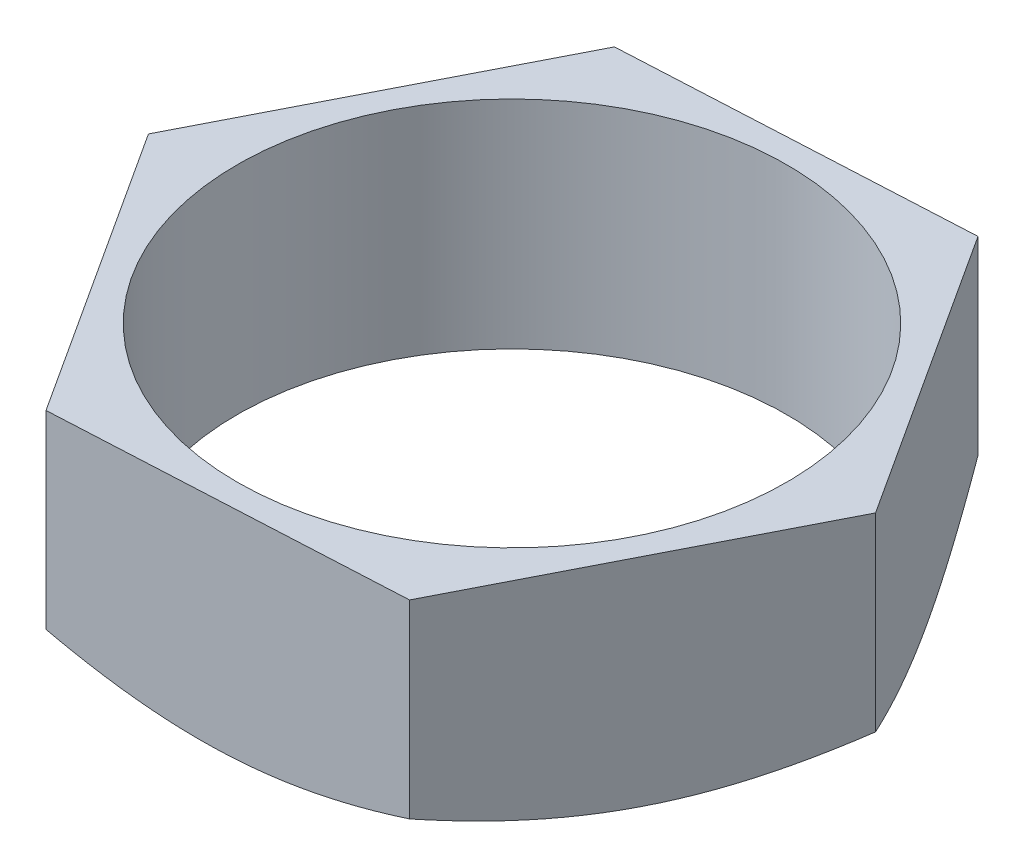
ISO-10303-21;
HEADER;
FILE_DESCRIPTION(('STEP AP214'),'2;1');
FILE_NAME('part.step','',(''),(''),'','','');
FILE_SCHEMA(('AUTOMOTIVE_DESIGN { 1 0 10303 214 1 1 1 1 }'));
ENDSEC;
DATA;
#1=APPLICATION_CONTEXT('core data for automotive mechanical design processes');
#2=APPLICATION_PROTOCOL_DEFINITION('international standard','automotive_design',2000,#1);
#3=PRODUCT_CONTEXT('',#1,'mechanical');
#4=PRODUCT('Part','Part','',(#3));
#5=PRODUCT_RELATED_PRODUCT_CATEGORY('part','',(#4));
#6=PRODUCT_DEFINITION_FORMATION('','',#4);
#7=PRODUCT_DEFINITION_CONTEXT('part definition',#1,'design');
#8=PRODUCT_DEFINITION('design','',#6,#7);
#9=PRODUCT_DEFINITION_SHAPE('','',#8);
#10=(LENGTH_UNIT() NAMED_UNIT(*) SI_UNIT(.MILLI.,.METRE.));
#11=(NAMED_UNIT(*) PLANE_ANGLE_UNIT() SI_UNIT($,.RADIAN.));
#12=(NAMED_UNIT(*) SI_UNIT($,.STERADIAN.) SOLID_ANGLE_UNIT());
#13=UNCERTAINTY_MEASURE_WITH_UNIT(LENGTH_MEASURE(1.E-05),#10,'distance_accuracy_value','');
#14=(GEOMETRIC_REPRESENTATION_CONTEXT(3) GLOBAL_UNCERTAINTY_ASSIGNED_CONTEXT((#13)) GLOBAL_UNIT_ASSIGNED_CONTEXT((#10,
#11,#12)) REPRESENTATION_CONTEXT('',''));
#15=CARTESIAN_POINT('',(0.,0.,0.));
#16=DIRECTION('',(0.,0.,1.));
#17=DIRECTION('',(1.,0.,0.));
#18=AXIS2_PLACEMENT_3D('',#15,#16,#17);
#19=CARTESIAN_POINT('',(0.,0.,0.));
#20=DIRECTION('',(0.,1.,0.));
#21=DIRECTION('',(0.,0.,1.));
#22=AXIS2_PLACEMENT_3D('',#19,#20,#21);
#23=PLANE('',#22);
#24=CARTESIAN_POINT('',(0.,0.,0.));
#25=DIRECTION('',(0.,1.,0.));
#26=DIRECTION('',(0.,0.,1.));
#27=AXIS2_PLACEMENT_3D('',#24,#25,#26);
#28=CIRCLE('',#27,6.35);
#29=CARTESIAN_POINT('',(0.,0.,6.35));
#30=VERTEX_POINT('',#29);
#31=EDGE_CURVE('E261',#30,#30,#28,.T.);
#32=ORIENTED_EDGE('',*,*,#31,.T.);
#33=EDGE_LOOP('',(#32));
#34=FACE_BOUND('',#33,.T.);
#35=CARTESIAN_POINT('',(0.,0.,0.));
#36=DIRECTION('',(0.,-1.,0.));
#37=DIRECTION('',(0.,0.,-1.));
#38=AXIS2_PLACEMENT_3D('',#35,#36,#37);
#39=CIRCLE('',#38,6.92820323027551);
#40=CARTESIAN_POINT('',(6.16907881852297,0.,3.15316769786374));
#41=VERTEX_POINT('',#40);
#42=CARTESIAN_POINT('',(0.35381608051899,0.,6.91916282372125));
#43=VERTEX_POINT('',#42);
#44=EDGE_CURVE('E118',#41,#43,#39,.T.);
#45=ORIENTED_EDGE('',*,*,#44,.T.);
#46=CARTESIAN_POINT('',(-5.81526273800398,0.,3.76599512585751));
#47=VERTEX_POINT('',#46);
#48=EDGE_CURVE('E107',#43,#47,#39,.T.);
#49=ORIENTED_EDGE('',*,*,#48,.T.);
#50=CARTESIAN_POINT('',(-6.16907881852297,0.,-3.15316769786374));
#51=VERTEX_POINT('',#50);
#52=EDGE_CURVE('E119',#47,#51,#39,.T.);
#53=ORIENTED_EDGE('',*,*,#52,.T.);
#54=CARTESIAN_POINT('',(-0.353816080518988,0.,-6.91916282372125));
#55=VERTEX_POINT('',#54);
#56=EDGE_CURVE('E279',#51,#55,#39,.T.);
#57=ORIENTED_EDGE('',*,*,#56,.T.);
#58=CARTESIAN_POINT('',(5.81526273800398,0.,-3.76599512585751));
#59=VERTEX_POINT('',#58);
#60=EDGE_CURVE('E138',#55,#59,#39,.T.);
#61=ORIENTED_EDGE('',*,*,#60,.T.);
#62=EDGE_CURVE('E53',#59,#41,#39,.T.);
#63=ORIENTED_EDGE('',*,*,#62,.T.);
#64=EDGE_LOOP('',(#45,#49,#53,#57,#61,#63));
#65=FACE_BOUND('',#64,.T.);
#66=ADVANCED_FACE('F33',(#34,#65),#23,.F.);
#67=CARTESIAN_POINT('',(7.98956103768463,5.,-0.408551618662516));
#68=DIRECTION('',(-0.839360876798749,0.,0.543574574920163));
#69=DIRECTION('',(0.543574574920163,0.,0.839360876798749));
#70=AXIS2_PLACEMENT_3D('',#67,#68,#69);
#71=PLANE('',#70);
#72=CARTESIAN_POINT('',(3.64083491725797,0.61887093956387,-7.12363863305251));
#73=CARTESIAN_POINT('',(3.73642202467926,0.568115199335291,-6.97603776649693));
#74=CARTESIAN_POINT('',(3.83236552712366,0.519662935744057,-6.82788657243732));
#75=CARTESIAN_POINT('',(4.02503169663145,0.42799978647294,-6.53038103698936));
#76=CARTESIAN_POINT('',(4.12175468077262,0.384791161852838,-6.38102620598527));
#77=CARTESIAN_POINT('',(4.41347229011371,0.263878862406307,-5.93057035383263));
#78=CARTESIAN_POINT('',(4.60961842442482,0.195105260290996,-5.62769122947284));
#79=CARTESIAN_POINT('',(4.90314754605218,0.114459988531889,-5.17443812996705));
#80=CARTESIAN_POINT('',(4.99965349862305,0.0914864615273886,-5.02541842834087));
#81=CARTESIAN_POINT('',(5.19310146458787,0.0529631493144572,-4.72670568161055));
#82=CARTESIAN_POINT('',(5.29004343868931,0.0374127081807483,-4.57701269717997));
#83=CARTESIAN_POINT('',(5.48409575553106,0.0141318753304187,-4.27736674182408));
#84=CARTESIAN_POINT('',(5.58120578133457,0.00639260875546628,-4.12741426029686));
#85=CARTESIAN_POINT('',(5.77551017839809,-0.00110822728907233,-3.82737905517519));
#86=CARTESIAN_POINT('',(5.87270454695972,-0.000870043208922834,-3.67729633574747));
#87=CARTESIAN_POINT('',(6.13898563527347,0.0107480068437652,-3.26611829675479));
#88=CARTESIAN_POINT('',(6.30798519005466,0.0302518528030116,-3.00515757301127));
#89=CARTESIAN_POINT('',(6.6448618183566,0.092098779830511,-2.48496940536922));
#90=CARTESIAN_POINT('',(6.81273770713315,0.13446299987481,-2.22574379089389));
#91=CARTESIAN_POINT('',(7.15029230064105,0.24036128163059,-1.70450874303343));
#92=CARTESIAN_POINT('',(7.31992841228258,0.304344023962348,-1.44256507978341));
#93=CARTESIAN_POINT('',(7.65667088005869,0.449559043679214,-0.922584076165926));
#94=CARTESIAN_POINT('',(7.82378154876104,0.530757210595676,-0.664540076545389));
#95=CARTESIAN_POINT('',(7.98969055874999,0.618870939563869,-0.408351618662516));
#96=B_SPLINE_CURVE_WITH_KNOTS('',3,(#72,#73,#74,#75,#76,#77,#78,#79,#80,#81,#82,#83,#84,#85,#86,
#87,#88,#89,#90,#91,#92,#93,#94,#95),.UNSPECIFIED.,.F.,.F.,(4,2,2,2,2,2,2,2,2,2,2,4),(0.,
0.549038574805348,1.09831306040419,2.19914443104398,2.73607817580193,3.27296446675901,
3.80924007211702,4.34549911013435,5.27906525860638,6.21349615824478,7.16865151028677,
8.12193172415134),.UNSPECIFIED.);
#97=CARTESIAN_POINT('',(3.64096443832333,0.618802153517004,-7.12343863305251));
#98=VERTEX_POINT('',#97);
#99=EDGE_CURVE('E136',#98,#59,#96,.T.);
#100=ORIENTED_EDGE('',*,*,#99,.F.);
#101=DIRECTION('',(0.,-1.,0.));
#102=VECTOR('',#101,1.);
#103=CARTESIAN_POINT('',(3.64096443832333,5.,-7.12343863305251));
#104=LINE('',#103,#102);
#105=CARTESIAN_POINT('',(3.64096443832333,5.,-7.12343863305251));
#106=VERTEX_POINT('',#105);
#107=EDGE_CURVE('E236',#106,#98,#104,.T.);
#108=ORIENTED_EDGE('',*,*,#107,.F.);
#109=DIRECTION('',(-0.543574574920163,0.,-0.839360876798749));
#110=VECTOR('',#109,1.);
#111=CARTESIAN_POINT('',(7.98956103768463,5.,-0.408551618662516));
#112=LINE('',#111,#110);
#113=CARTESIAN_POINT('',(7.98956103768463,5.,-0.408551618662516));
#114=VERTEX_POINT('',#113);
#115=EDGE_CURVE('E221',#114,#106,#112,.T.);
#116=ORIENTED_EDGE('',*,*,#115,.F.);
#117=DIRECTION('',(0.,-1.,0.));
#118=VECTOR('',#117,1.);
#119=CARTESIAN_POINT('',(7.98956103768463,5.,-0.408551618662516));
#120=LINE('',#119,#118);
#121=CARTESIAN_POINT('',(7.98956103768463,0.618802153517004,-0.408551618662515));
#122=VERTEX_POINT('',#121);
#123=EDGE_CURVE('E215',#114,#122,#120,.T.);
#124=ORIENTED_EDGE('',*,*,#123,.T.);
#125=EDGE_CURVE('E129',#59,#122,#96,.T.);
#126=ORIENTED_EDGE('',*,*,#125,.F.);
#127=EDGE_LOOP('',(#100,#108,#116,#124,#126));
#128=FACE_BOUND('',#127,.T.);
#129=ADVANCED_FACE('F35',(#128),#71,.F.);
#130=CARTESIAN_POINT('',(3.64096443832333,5.,-7.12343863305251));
#131=DIRECTION('',(0.051068952332814,0.,0.998695129710578));
#132=DIRECTION('',(0.998695129710578,0.,-0.051068952332814));
#133=AXIS2_PLACEMENT_3D('',#130,#131,#132);
#134=PLANE('',#133);
#135=CARTESIAN_POINT('',(-4.3487965993613,0.618859965064425,-6.71487678725444));
#136=CARTESIAN_POINT('',(-4.17317726526415,0.56810467887728,-6.72385720093116));
#137=CARTESIAN_POINT('',(-3.99690313762514,0.519652880306709,-6.73287109791944));
#138=CARTESIAN_POINT('',(-3.642923350534,0.427990681264755,-6.75097209424549));
#139=CARTESIAN_POINT('',(-3.46521710852659,0.384782541859749,-6.76005922337263));
#140=CARTESIAN_POINT('',(-2.92925311379517,0.263871731938269,-6.78746610549788));
#141=CARTESIAN_POINT('',(-2.56887973901881,0.195099159829299,-6.80589404226353));
#142=CARTESIAN_POINT('',(-2.02958754678634,0.114455422849705,-6.83347111402372));
#143=CARTESIAN_POINT('',(-1.852280053513,0.0914823978318176,-6.84253785286408));
#144=CARTESIAN_POINT('',(-1.49686392370309,0.0529600848180451,-6.86071229754855));
#145=CARTESIAN_POINT('',(-1.31875535935547,0.0374101409010253,-6.86981999970123));
#146=CARTESIAN_POINT('',(-0.96222890858955,0.0141302848300211,-6.88805122140032));
#147=CARTESIAN_POINT('',(-0.783811604434302,0.00639149801764774,-6.89717471117231));
#148=CARTESIAN_POINT('',(-0.426822051538732,-0.00110840719038422,-6.91542961391267));
#149=CARTESIAN_POINT('',(-0.248249807755767,-0.000869772050792777,-6.92456102662754));
#150=CARTESIAN_POINT('',(0.240975346651635,0.0107493392895683,-6.94957788647513));
#151=CARTESIAN_POINT('',(0.551468098255518,0.0302533681376942,-6.96545514376779));
#152=CARTESIAN_POINT('',(1.17039134300866,0.0920998006210819,-6.99710420336932));
#153=CARTESIAN_POINT('',(1.47881965964196,0.134463341267003,-7.01287589438057));
#154=CARTESIAN_POINT('',(2.09898839851385,0.240359502423459,-7.04458864316801));
#155=CARTESIAN_POINT('',(2.4106505705561,0.30434077627936,-7.06052569956738));
#156=CARTESIAN_POINT('',(3.02932725715202,0.449552301060211,-7.09216215125043));
#157=CARTESIAN_POINT('',(3.33634969438419,0.530748444288054,-7.10786195166566));
#158=CARTESIAN_POINT('',(3.64116443832333,0.618859965064425,-7.12344886018806));
#159=B_SPLINE_CURVE_WITH_KNOTS('',3,(#135,#136,#137,#138,#139,#140,#141,#142,#143,#144,#145,
#146,#147,#148,#149,#150,#151,#152,#153,#154,#155,#156,#157,#158),.UNSPECIFIED.,.F.,.F.,(4,2,2,
2,2,2,2,2,2,2,2,4),(0.,0.549037274261788,1.09831045855129,2.19913915498056,2.73607172248169,
3.27295683655553,3.80923127881788,4.34548915274212,5.27903847804473,6.21345249109815,
7.16859006307516,8.12185262295156),.UNSPECIFIED.);
#160=CARTESIAN_POINT('',(-4.3485965993613,0.618802153517003,-6.71488701438999));
#161=VERTEX_POINT('',#160);
#162=EDGE_CURVE('E276',#161,#55,#159,.T.);
#163=ORIENTED_EDGE('',*,*,#162,.F.);
#164=DIRECTION('',(0.,-1.,0.));
#165=VECTOR('',#164,1.);
#166=CARTESIAN_POINT('',(-4.3485965993613,5.,-6.71488701438999));
#167=LINE('',#166,#165);
#168=CARTESIAN_POINT('',(-4.3485965993613,5.,-6.71488701438999));
#169=VERTEX_POINT('',#168);
#170=EDGE_CURVE('E234',#169,#161,#167,.T.);
#171=ORIENTED_EDGE('',*,*,#170,.F.);
#172=DIRECTION('',(-0.998695129710578,0.,0.051068952332814));
#173=VECTOR('',#172,1.);
#174=CARTESIAN_POINT('',(3.64096443832333,5.,-7.12343863305251));
#175=LINE('',#174,#173);
#176=EDGE_CURVE('E241',#106,#169,#175,.T.);
#177=ORIENTED_EDGE('',*,*,#176,.F.);
#178=ORIENTED_EDGE('',*,*,#107,.T.);
#179=EDGE_CURVE('E174',#55,#98,#159,.T.);
#180=ORIENTED_EDGE('',*,*,#179,.F.);
#181=EDGE_LOOP('',(#163,#171,#177,#178,#180));
#182=FACE_BOUND('',#181,.T.);
#183=ADVANCED_FACE('F186',(#182),#134,.F.);
#184=CARTESIAN_POINT('',(-4.3485965993613,5.,-6.71488701438999));
#185=DIRECTION('',(0.890429829131563,0.,0.455120554790415));
#186=DIRECTION('',(0.455120554790415,0.,-0.890429829131563));
#187=AXIS2_PLACEMENT_3D('',#184,#185,#186);
#188=PLANE('',#187);
#189=CARTESIAN_POINT('',(-7.98966326259666,0.618866994384585,0.408751618662515));
#190=CARTESIAN_POINT('',(-7.90963076861918,0.568111417377126,0.252170424543161));
#191=CARTESIAN_POINT('',(-7.82929987481131,0.519659320953879,0.0950054200307493));
#192=CARTESIAN_POINT('',(-7.66798571444291,0.427996513275969,-0.220600936881611));
#193=CARTESIAN_POINT('',(-7.58700218240213,0.384788063083458,-0.379042808685781));
#194=CARTESIAN_POINT('',(-7.3427549431192,0.263876299099011,-0.856905267876851));
#195=CARTESIAN_POINT('',(-7.17852711034747,0.195103067255689,-1.17821213818712));
#196=CARTESIAN_POINT('',(-6.93276314746032,0.114458347227141,-1.65904202199905));
#197=CARTESIAN_POINT('',(-6.85196133058139,0.0914850006794151,-1.81712837349367));
#198=CARTESIAN_POINT('',(-6.68999259790593,0.052962047663875,-2.13401538165634));
#199=CARTESIAN_POINT('',(-6.60882571500763,0.0374117852722727,-2.29281597395997));
#200=CARTESIAN_POINT('',(-6.44635098143223,0.0141313035598346,-2.61069295783374));
#201=CARTESIAN_POINT('',(-6.36504339611193,0.00639220945254382,-2.76976883024121));
#202=CARTESIAN_POINT('',(-6.20235760871444,-0.00110829196976968,-3.08805873464069));
#203=CARTESIAN_POINT('',(-6.1209794088965,-0.000869945740264138,-3.24727276221256));
#204=CARTESIAN_POINT('',(-5.89803031152865,0.0107484858329295,-3.68346604020175));
#205=CARTESIAN_POINT('',(-5.75653239704574,0.0302523975402912,-3.96030250141918));
#206=CARTESIAN_POINT('',(-5.47447638420087,0.0920991467891393,-4.51213670156564));
#207=CARTESIAN_POINT('',(-5.33391927776378,0.13446312260013,-4.78713249982318));
#208=CARTESIAN_POINT('',(-5.05129564122731,0.240360642031067,-5.34007723883986));
#209=CARTESIAN_POINT('',(-4.90926477237884,0.304342856466234,-5.61795640942224));
#210=CARTESIAN_POINT('',(-4.62732109981532,0.449556619802126,-6.16957081914951));
#211=CARTESIAN_POINT('',(-4.48740468541448,0.530754059230552,-6.44331312249376));
#212=CARTESIAN_POINT('',(-4.34849437444927,0.618866994384585,-6.71508701438999));
#213=B_SPLINE_CURVE_WITH_KNOTS('',3,(#189,#190,#191,#192,#193,#194,#195,#196,#197,#198,#199,
#200,#201,#202,#203,#204,#205,#206,#207,#208,#209,#210,#211,#212),.UNSPECIFIED.,.F.,.F.,(4,2,2,
2,2,2,2,2,2,2,2,4),(0.,0.549038107278163,1.09831212507454,2.19914253437313,2.73607585592367,
3.27296172380765,3.80923691104901,4.34549553059112,5.27905563138459,6.21348046054716,
7.168629420918,8.12190328843477),.UNSPECIFIED.);
#214=CARTESIAN_POINT('',(-7.98956103768463,0.618802153517002,0.408551618662515));
#215=VERTEX_POINT('',#214);
#216=EDGE_CURVE('E262',#215,#51,#213,.T.);
#217=ORIENTED_EDGE('',*,*,#216,.F.);
#218=DIRECTION('',(0.,-1.,0.));
#219=VECTOR('',#218,1.);
#220=CARTESIAN_POINT('',(-7.98956103768463,5.,0.408551618662515));
#221=LINE('',#220,#219);
#222=CARTESIAN_POINT('',(-7.98956103768463,5.,0.408551618662515));
#223=VERTEX_POINT('',#222);
#224=EDGE_CURVE('E231',#223,#215,#221,.T.);
#225=ORIENTED_EDGE('',*,*,#224,.F.);
#226=DIRECTION('',(-0.455120554790415,0.,0.890429829131563));
#227=VECTOR('',#226,1.);
#228=CARTESIAN_POINT('',(-4.3485965993613,5.,-6.71488701438999));
#229=LINE('',#228,#227);
#230=EDGE_CURVE('E268',#169,#223,#229,.T.);
#231=ORIENTED_EDGE('',*,*,#230,.F.);
#232=ORIENTED_EDGE('',*,*,#170,.T.);
#233=EDGE_CURVE('E161',#51,#161,#213,.T.);
#234=ORIENTED_EDGE('',*,*,#233,.F.);
#235=EDGE_LOOP('',(#217,#225,#231,#232,#234));
#236=FACE_BOUND('',#235,.T.);
#237=ADVANCED_FACE('F182',(#236),#188,.F.);
#238=CARTESIAN_POINT('',(-7.98956103768463,5.,0.408551618662515));
#239=DIRECTION('',(0.839360876798749,0.,-0.543574574920163));
#240=DIRECTION('',(-0.543574574920163,0.,-0.839360876798749));
#241=AXIS2_PLACEMENT_3D('',#238,#239,#240);
#242=PLANE('',#241);
#243=CARTESIAN_POINT('',(-3.64083491725796,0.618870939563869,7.12363863305251));
#244=CARTESIAN_POINT('',(-3.73642202467926,0.56811519933529,6.97603776649693));
#245=CARTESIAN_POINT('',(-3.83236552712365,0.519662935744056,6.82788657243732));
#246=CARTESIAN_POINT('',(-4.02503169663145,0.42799978647294,6.53038103698936));
#247=CARTESIAN_POINT('',(-4.12175468077261,0.384791161852837,6.38102620598527));
#248=CARTESIAN_POINT('',(-4.4134722901137,0.263878862406306,5.93057035383263));
#249=CARTESIAN_POINT('',(-4.60961842442481,0.195105260290995,5.62769122947285));
#250=CARTESIAN_POINT('',(-4.90314754605218,0.114459988531888,5.17443812996705));
#251=CARTESIAN_POINT('',(-4.99965349862304,0.0914864615273879,5.02541842834087));
#252=CARTESIAN_POINT('',(-5.19310146458786,0.0529631493144563,4.72670568161055));
#253=CARTESIAN_POINT('',(-5.2900434386893,0.0374127081807473,4.57701269717997));
#254=CARTESIAN_POINT('',(-5.48409575553106,0.0141318753304172,4.27736674182408));
#255=CARTESIAN_POINT('',(-5.58120578133456,0.00639260875546466,4.12741426029686));
#256=CARTESIAN_POINT('',(-5.77551017839809,-0.00110822728907396,3.8273790551752));
#257=CARTESIAN_POINT('',(-5.87270454695971,-0.000870043208924313,3.67729633574748));
#258=CARTESIAN_POINT('',(-6.13898563527347,0.0107480068437637,3.26611829675479));
#259=CARTESIAN_POINT('',(-6.30798519005466,0.0302518528030095,3.00515757301127));
#260=CARTESIAN_POINT('',(-6.6448618183566,0.0920987798305089,2.48496940536922));
#261=CARTESIAN_POINT('',(-6.81273770713314,0.134462999874809,2.22574379089389));
#262=CARTESIAN_POINT('',(-7.15029230064105,0.240361281630589,1.70450874303343));
#263=CARTESIAN_POINT('',(-7.31992841228258,0.304344023962347,1.44256507978341));
#264=CARTESIAN_POINT('',(-7.65667088005869,0.449559043679213,0.922584076165925));
#265=CARTESIAN_POINT('',(-7.82378154876104,0.530757210595675,0.664540076545389));
#266=CARTESIAN_POINT('',(-7.98969055874999,0.618870939563868,0.408351618662515));
#267=B_SPLINE_CURVE_WITH_KNOTS('',3,(#243,#244,#245,#246,#247,#248,#249,#250,#251,#252,#253,
#254,#255,#256,#257,#258,#259,#260,#261,#262,#263,#264,#265,#266),.UNSPECIFIED.,.F.,.F.,(4,2,2,
2,2,2,2,2,2,2,2,4),(0.,0.549038574805348,1.09831306040418,2.19914443104398,2.73607817580192,
3.27296446675901,3.80924007211702,4.34549911013435,5.27906525860638,6.21349615824478,
7.16865151028677,8.12193172415134),.UNSPECIFIED.);
#268=CARTESIAN_POINT('',(-3.64096443832332,0.618802153517004,7.12343863305251));
#269=VERTEX_POINT('',#268);
#270=EDGE_CURVE('E113',#269,#47,#267,.T.);
#271=ORIENTED_EDGE('',*,*,#270,.F.);
#272=DIRECTION('',(0.,-1.,0.));
#273=VECTOR('',#272,1.);
#274=CARTESIAN_POINT('',(-3.64096443832332,5.,7.12343863305251));
#275=LINE('',#274,#273);
#276=CARTESIAN_POINT('',(-3.64096443832332,5.,7.12343863305251));
#277=VERTEX_POINT('',#276);
#278=EDGE_CURVE('E135',#277,#269,#275,.T.);
#279=ORIENTED_EDGE('',*,*,#278,.F.);
#280=DIRECTION('',(0.543574574920163,0.,0.839360876798749));
#281=VECTOR('',#280,1.);
#282=CARTESIAN_POINT('',(-7.98956103768463,5.,0.408551618662515));
#283=LINE('',#282,#281);
#284=EDGE_CURVE('E270',#223,#277,#283,.T.);
#285=ORIENTED_EDGE('',*,*,#284,.F.);
#286=ORIENTED_EDGE('',*,*,#224,.T.);
#287=EDGE_CURVE('E175',#47,#215,#267,.T.);
#288=ORIENTED_EDGE('',*,*,#287,.F.);
#289=EDGE_LOOP('',(#271,#279,#285,#286,#288));
#290=FACE_BOUND('',#289,.T.);
#291=ADVANCED_FACE('F179',(#290),#242,.F.);
#292=CARTESIAN_POINT('',(-3.64096443832332,5.,7.12343863305251));
#293=DIRECTION('',(-0.0510689523328142,0.,-0.998695129710578));
#294=DIRECTION('',(-0.998695129710578,0.,0.0510689523328142));
#295=AXIS2_PLACEMENT_3D('',#292,#293,#294);
#296=PLANE('',#295);
#297=CARTESIAN_POINT('',(4.3487965993613,0.618859965064425,6.71487678725444));
#298=CARTESIAN_POINT('',(4.17317726526415,0.56810467887728,6.72385720093116));
#299=CARTESIAN_POINT('',(3.99690313762515,0.519652880306709,6.73287109791944));
#300=CARTESIAN_POINT('',(3.642923350534,0.427990681264755,6.75097209424549));
#301=CARTESIAN_POINT('',(3.46521710852659,0.384782541859749,6.76005922337263));
#302=CARTESIAN_POINT('',(2.92925311379517,0.263871731938269,6.78746610549788));
#303=CARTESIAN_POINT('',(2.56887973901882,0.1950991598293,6.80589404226353));
#304=CARTESIAN_POINT('',(2.02958754678634,0.114455422849706,6.83347111402372));
#305=CARTESIAN_POINT('',(1.852280053513,0.0914823978318187,6.84253785286408));
#306=CARTESIAN_POINT('',(1.49686392370309,0.0529600848180459,6.86071229754855));
#307=CARTESIAN_POINT('',(1.31875535935547,0.0374101409010259,6.86981999970123));
#308=CARTESIAN_POINT('',(0.962228908589552,0.0141302848300214,6.88805122140032));
#309=CARTESIAN_POINT('',(0.783811604434303,0.00639149801764818,6.89717471117231));
#310=CARTESIAN_POINT('',(0.426822051538733,-0.00110840719038361,6.91542961391267));
#311=CARTESIAN_POINT('',(0.248249807755768,-0.000869772050792136,6.92456102662754));
#312=CARTESIAN_POINT('',(-0.240975346651634,0.0107493392895688,6.94957788647513));
#313=CARTESIAN_POINT('',(-0.551468098255517,0.0302533681376943,6.96545514376779));
#314=CARTESIAN_POINT('',(-1.17039134300866,0.0920998006210822,6.99710420336933));
#315=CARTESIAN_POINT('',(-1.47881965964195,0.134463341267004,7.01287589438058));
#316=CARTESIAN_POINT('',(-2.09898839851385,0.24035950242346,7.04458864316801));
#317=CARTESIAN_POINT('',(-2.4106505705561,0.30434077627936,7.06052569956738));
#318=CARTESIAN_POINT('',(-3.02932725715202,0.44955230106021,7.09216215125043));
#319=CARTESIAN_POINT('',(-3.33634969438419,0.530748444288053,7.10786195166566));
#320=CARTESIAN_POINT('',(-3.64116443832332,0.618859965064425,7.12344886018806));
#321=B_SPLINE_CURVE_WITH_KNOTS('',3,(#297,#298,#299,#300,#301,#302,#303,#304,#305,#306,#307,
#308,#309,#310,#311,#312,#313,#314,#315,#316,#317,#318,#319,#320),.UNSPECIFIED.,.F.,.F.,(4,2,2,
2,2,2,2,2,2,2,2,4),(0.,0.549037274261788,1.09831045855129,2.19913915498056,2.73607172248169,
3.27295683655553,3.80923127881788,4.34548915274212,5.27903847804473,6.21345249109815,
7.16859006307515,8.12185262295156),.UNSPECIFIED.);
#322=CARTESIAN_POINT('',(4.3485965993613,0.618802153517004,6.71488701438999));
#323=VERTEX_POINT('',#322);
#324=EDGE_CURVE('E123',#323,#43,#321,.T.);
#325=ORIENTED_EDGE('',*,*,#324,.F.);
#326=DIRECTION('',(0.,-1.,0.));
#327=VECTOR('',#326,1.);
#328=CARTESIAN_POINT('',(4.3485965993613,5.,6.71488701438999));
#329=LINE('',#328,#327);
#330=CARTESIAN_POINT('',(4.3485965993613,5.,6.71488701438999));
#331=VERTEX_POINT('',#330);
#332=EDGE_CURVE('E222',#331,#323,#329,.T.);
#333=ORIENTED_EDGE('',*,*,#332,.F.);
#334=DIRECTION('',(0.998695129710578,0.,-0.0510689523328142));
#335=VECTOR('',#334,1.);
#336=CARTESIAN_POINT('',(-3.64096443832332,5.,7.12343863305251));
#337=LINE('',#336,#335);
#338=EDGE_CURVE('E226',#277,#331,#337,.T.);
#339=ORIENTED_EDGE('',*,*,#338,.F.);
#340=ORIENTED_EDGE('',*,*,#278,.T.);
#341=EDGE_CURVE('E111',#43,#269,#321,.T.);
#342=ORIENTED_EDGE('',*,*,#341,.F.);
#343=EDGE_LOOP('',(#325,#333,#339,#340,#342));
#344=FACE_BOUND('',#343,.T.);
#345=ADVANCED_FACE('F132',(#344),#296,.F.);
#346=CARTESIAN_POINT('',(4.3485965993613,5.,6.71488701438999));
#347=DIRECTION('',(-0.890429829131563,0.,-0.455120554790415));
#348=DIRECTION('',(-0.455120554790416,0.,0.890429829131563));
#349=AXIS2_PLACEMENT_3D('',#346,#347,#348);
#350=PLANE('',#349);
#351=CARTESIAN_POINT('',(7.98966326259667,0.618866994384586,-0.408751618662516));
#352=CARTESIAN_POINT('',(7.90963076861918,0.568111417377127,-0.252170424543162));
#353=CARTESIAN_POINT('',(7.82929987481131,0.51965932095388,-0.0950054200307506));
#354=CARTESIAN_POINT('',(7.66798571444291,0.42799651327597,0.22060093688161));
#355=CARTESIAN_POINT('',(7.58700218240213,0.384788063083459,0.37904280868578));
#356=CARTESIAN_POINT('',(7.3427549431192,0.263876299099012,0.856905267876851));
#357=CARTESIAN_POINT('',(7.17852711034747,0.195103067255691,1.17821213818712));
#358=CARTESIAN_POINT('',(6.93276314746032,0.114458347227142,1.65904202199905));
#359=CARTESIAN_POINT('',(6.85196133058139,0.0914850006794159,1.81712837349367));
#360=CARTESIAN_POINT('',(6.68999259790593,0.0529620476638756,2.13401538165634));
#361=CARTESIAN_POINT('',(6.60882571500763,0.0374117852722735,2.29281597395997));
#362=CARTESIAN_POINT('',(6.44635098143223,0.0141313035598353,2.61069295783374));
#363=CARTESIAN_POINT('',(6.36504339611193,0.00639220945254445,2.76976883024121));
#364=CARTESIAN_POINT('',(6.20235760871444,-0.00110829196976905,3.08805873464069));
#365=CARTESIAN_POINT('',(6.1209794088965,-0.000869945740263427,3.24727276221256));
#366=CARTESIAN_POINT('',(5.89803031152865,0.0107484858329303,3.68346604020175));
#367=CARTESIAN_POINT('',(5.75653239704574,0.030252397540292,3.96030250141918));
#368=CARTESIAN_POINT('',(5.47447638420087,0.0920991467891399,4.51213670156564));
#369=CARTESIAN_POINT('',(5.33391927776378,0.13446312260013,4.78713249982318));
#370=CARTESIAN_POINT('',(5.05129564122731,0.240360642031067,5.34007723883986));
#371=CARTESIAN_POINT('',(4.90926477237884,0.304342856466234,5.61795640942224));
#372=CARTESIAN_POINT('',(4.62732109981532,0.449556619802127,6.16957081914951));
#373=CARTESIAN_POINT('',(4.48740468541448,0.530754059230553,6.44331312249376));
#374=CARTESIAN_POINT('',(4.34849437444927,0.618866994384586,6.71508701438999));
#375=B_SPLINE_CURVE_WITH_KNOTS('',3,(#351,#352,#353,#354,#355,#356,#357,#358,#359,#360,#361,
#362,#363,#364,#365,#366,#367,#368,#369,#370,#371,#372,#373,#374),.UNSPECIFIED.,.F.,.F.,(4,2,2,
2,2,2,2,2,2,2,2,4),(0.,0.549038107278163,1.09831212507454,2.19914253437313,2.73607585592367,
3.27296172380765,3.80923691104901,4.34549553059112,5.27905563138459,6.21348046054716,
7.168629420918,8.12190328843477),.UNSPECIFIED.);
#376=EDGE_CURVE('E12',#122,#41,#375,.T.);
#377=ORIENTED_EDGE('',*,*,#376,.F.);
#378=ORIENTED_EDGE('',*,*,#123,.F.);
#379=DIRECTION('',(0.455120554790415,0.,-0.890429829131563));
#380=VECTOR('',#379,1.);
#381=CARTESIAN_POINT('',(4.3485965993613,5.,6.71488701438999));
#382=LINE('',#381,#380);
#383=EDGE_CURVE('E223',#331,#114,#382,.T.);
#384=ORIENTED_EDGE('',*,*,#383,.F.);
#385=ORIENTED_EDGE('',*,*,#332,.T.);
#386=EDGE_CURVE('E38',#41,#323,#375,.T.);
#387=ORIENTED_EDGE('',*,*,#386,.F.);
#388=EDGE_LOOP('',(#377,#378,#384,#385,#387));
#389=FACE_BOUND('',#388,.T.);
#390=ADVANCED_FACE('F203',(#389),#350,.F.);
#391=CARTESIAN_POINT('',(0.,5.,0.));
#392=DIRECTION('',(0.,1.,0.));
#393=DIRECTION('',(0.,0.,1.));
#394=AXIS2_PLACEMENT_3D('',#391,#392,#393);
#395=PLANE('',#394);
#396=ORIENTED_EDGE('',*,*,#115,.T.);
#397=ORIENTED_EDGE('',*,*,#176,.T.);
#398=ORIENTED_EDGE('',*,*,#230,.T.);
#399=ORIENTED_EDGE('',*,*,#284,.T.);
#400=ORIENTED_EDGE('',*,*,#338,.T.);
#401=ORIENTED_EDGE('',*,*,#383,.T.);
#402=EDGE_LOOP('',(#396,#397,#398,#399,#400,#401));
#403=FACE_BOUND('',#402,.T.);
#404=CARTESIAN_POINT('',(0.,5.,0.));
#405=DIRECTION('',(0.,1.,0.));
#406=DIRECTION('',(0.,0.,1.));
#407=AXIS2_PLACEMENT_3D('',#404,#405,#406);
#408=CIRCLE('',#407,6.35);
#409=CARTESIAN_POINT('',(0.,5.,6.35));
#410=VERTEX_POINT('',#409);
#411=EDGE_CURVE('E259',#410,#410,#408,.T.);
#412=ORIENTED_EDGE('',*,*,#411,.F.);
#413=EDGE_LOOP('',(#412));
#414=FACE_BOUND('',#413,.T.);
#415=ADVANCED_FACE('F202',(#403,#414),#395,.T.);
#416=CARTESIAN_POINT('',(0.,5.,0.));
#417=DIRECTION('',(0.,-1.,0.));
#418=DIRECTION('',(0.,0.,-1.));
#419=AXIS2_PLACEMENT_3D('',#416,#417,#418);
#420=CYLINDRICAL_SURFACE('',#419,6.35);
#421=ORIENTED_EDGE('',*,*,#411,.T.);
#422=EDGE_LOOP('',(#421));
#423=FACE_BOUND('',#422,.T.);
#424=ORIENTED_EDGE('',*,*,#31,.F.);
#425=EDGE_LOOP('',(#424));
#426=FACE_BOUND('',#425,.T.);
#427=ADVANCED_FACE('F156',(#423,#426),#420,.F.);
#428=CARTESIAN_POINT('',(0.,0.,0.));
#429=DIRECTION('',(0.,1.,0.));
#430=DIRECTION('',(0.,0.,-1.));
#431=AXIS2_PLACEMENT_3D('',#428,#429,#430);
#432=CONICAL_SURFACE('',#431,6.92820323027551,1.0471975511966);
#433=ORIENTED_EDGE('',*,*,#324,.T.);
#434=ORIENTED_EDGE('',*,*,#44,.F.);
#435=ORIENTED_EDGE('',*,*,#386,.T.);
#436=EDGE_LOOP('',(#433,#434,#435));
#437=FACE_BOUND('',#436,.T.);
#438=ADVANCED_FACE('F124',(#437),#432,.T.);
#439=ORIENTED_EDGE('',*,*,#125,.T.);
#440=ORIENTED_EDGE('',*,*,#376,.T.);
#441=ORIENTED_EDGE('',*,*,#62,.F.);
#442=EDGE_LOOP('',(#439,#440,#441));
#443=FACE_BOUND('',#442,.T.);
#444=ADVANCED_FACE('F243',(#443),#432,.T.);
#445=ORIENTED_EDGE('',*,*,#270,.T.);
#446=ORIENTED_EDGE('',*,*,#48,.F.);
#447=ORIENTED_EDGE('',*,*,#341,.T.);
#448=EDGE_LOOP('',(#445,#446,#447));
#449=FACE_BOUND('',#448,.T.);
#450=ADVANCED_FACE('F109',(#449),#432,.T.);
#451=ORIENTED_EDGE('',*,*,#216,.T.);
#452=ORIENTED_EDGE('',*,*,#52,.F.);
#453=ORIENTED_EDGE('',*,*,#287,.T.);
#454=EDGE_LOOP('',(#451,#452,#453));
#455=FACE_BOUND('',#454,.T.);
#456=ADVANCED_FACE('F150',(#455),#432,.T.);
#457=ORIENTED_EDGE('',*,*,#233,.T.);
#458=ORIENTED_EDGE('',*,*,#162,.T.);
#459=ORIENTED_EDGE('',*,*,#56,.F.);
#460=EDGE_LOOP('',(#457,#458,#459));
#461=FACE_BOUND('',#460,.T.);
#462=ADVANCED_FACE('F154',(#461),#432,.T.);
#463=ORIENTED_EDGE('',*,*,#179,.T.);
#464=ORIENTED_EDGE('',*,*,#99,.T.);
#465=ORIENTED_EDGE('',*,*,#60,.F.);
#466=EDGE_LOOP('',(#463,#464,#465));
#467=FACE_BOUND('',#466,.T.);
#468=ADVANCED_FACE('F249',(#467),#432,.T.);
#469=CLOSED_SHELL('',(#66,#129,#183,#237,#291,#345,#390,#415,#427,#438,#444,#450,#456,#462,#468));
#470=MANIFOLD_SOLID_BREP('B2',#469);
#471=ADVANCED_BREP_SHAPE_REPRESENTATION('',(#18,#470),#14);
#472=SHAPE_DEFINITION_REPRESENTATION(#9,#471);
ENDSEC;
END-ISO-10303-21;
